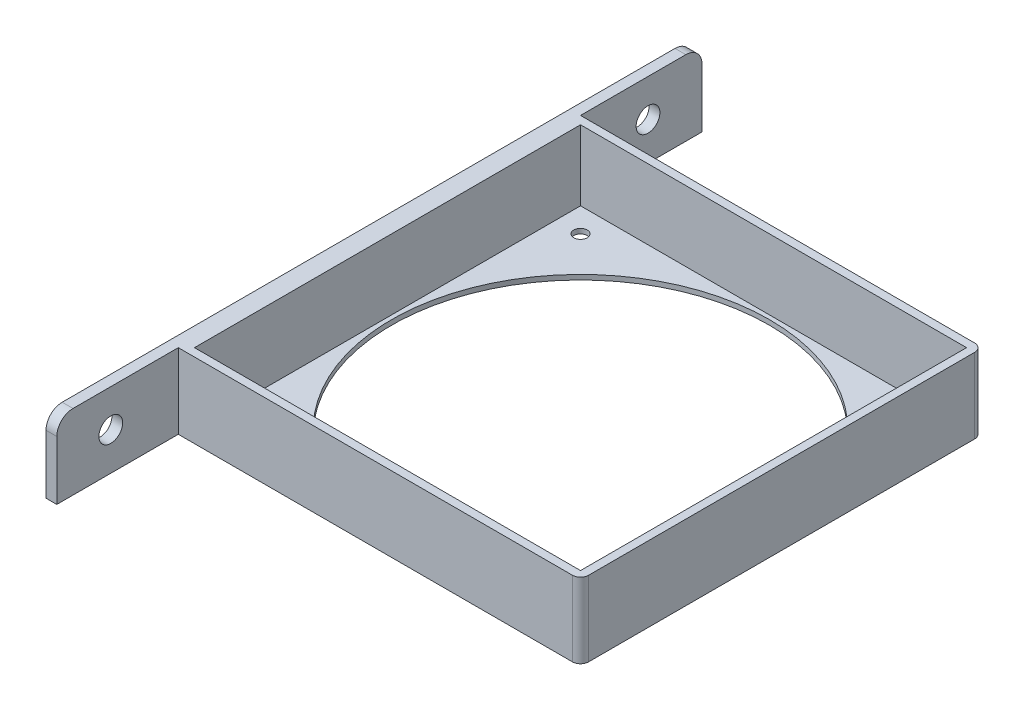
ISO-10303-21;
HEADER;
FILE_DESCRIPTION(('STEP AP214'),'2;1');
FILE_NAME('part.step','',(''),(''),'','','');
FILE_SCHEMA(('AUTOMOTIVE_DESIGN { 1 0 10303 214 1 1 1 1 }'));
ENDSEC;
DATA;
#1=APPLICATION_CONTEXT('core data for automotive mechanical design processes');
#2=APPLICATION_PROTOCOL_DEFINITION('international standard','automotive_design',2000,#1);
#3=PRODUCT_CONTEXT('',#1,'mechanical');
#4=PRODUCT('Part','Part','',(#3));
#5=PRODUCT_RELATED_PRODUCT_CATEGORY('part','',(#4));
#6=PRODUCT_DEFINITION_FORMATION('','',#4);
#7=PRODUCT_DEFINITION_CONTEXT('part definition',#1,'design');
#8=PRODUCT_DEFINITION('design','',#6,#7);
#9=PRODUCT_DEFINITION_SHAPE('','',#8);
#10=(LENGTH_UNIT() NAMED_UNIT(*) SI_UNIT(.MILLI.,.METRE.));
#11=(NAMED_UNIT(*) PLANE_ANGLE_UNIT() SI_UNIT($,.RADIAN.));
#12=(NAMED_UNIT(*) SI_UNIT($,.STERADIAN.) SOLID_ANGLE_UNIT());
#13=UNCERTAINTY_MEASURE_WITH_UNIT(LENGTH_MEASURE(1.E-05),#10,'distance_accuracy_value','');
#14=(GEOMETRIC_REPRESENTATION_CONTEXT(3) GLOBAL_UNCERTAINTY_ASSIGNED_CONTEXT((#13)) GLOBAL_UNIT_ASSIGNED_CONTEXT((#10,
#11,#12)) REPRESENTATION_CONTEXT('',''));
#15=CARTESIAN_POINT('',(0.,0.,0.));
#16=DIRECTION('',(0.,0.,1.));
#17=DIRECTION('',(1.,0.,0.));
#18=AXIS2_PLACEMENT_3D('',#15,#16,#17);
#19=CARTESIAN_POINT('',(71.5,26.,-71.5));
#20=DIRECTION('',(0.,1.,0.));
#21=DIRECTION('',(0.,0.,1.));
#22=AXIS2_PLACEMENT_3D('',#19,#20,#21);
#23=PLANE('',#22);
#24=DIRECTION('',(-1.,0.,0.));
#25=VECTOR('',#24,1.);
#26=CARTESIAN_POINT('',(-74.5,26.,-74.5));
#27=LINE('',#26,#25);
#28=CARTESIAN_POINT('',(71.5,26.,-74.5));
#29=VERTEX_POINT('',#28);
#30=CARTESIAN_POINT('',(-74.5,26.,-74.5));
#31=VERTEX_POINT('',#30);
#32=EDGE_CURVE('E256',#29,#31,#27,.T.);
#33=ORIENTED_EDGE('',*,*,#32,.T.);
#34=DIRECTION('',(0.,0.,-1.));
#35=VECTOR('',#34,1.);
#36=CARTESIAN_POINT('',(-74.5,26.,-113.5));
#37=LINE('',#36,#35);
#38=CARTESIAN_POINT('',(-74.5,26.,-113.5));
#39=VERTEX_POINT('',#38);
#40=EDGE_CURVE('E296',#31,#39,#37,.T.);
#41=ORIENTED_EDGE('',*,*,#40,.T.);
#42=DIRECTION('',(1.,0.,0.));
#43=VECTOR('',#42,1.);
#44=CARTESIAN_POINT('',(-78.5,26.,-113.5));
#45=LINE('',#44,#43);
#46=CARTESIAN_POINT('',(-78.5,26.,-113.5));
#47=VERTEX_POINT('',#46);
#48=EDGE_CURVE('E183',#47,#39,#45,.T.);
#49=ORIENTED_EDGE('',*,*,#48,.F.);
#50=DIRECTION('',(0.,0.,-1.));
#51=VECTOR('',#50,1.);
#52=CARTESIAN_POINT('',(-78.5,26.,-113.5));
#53=LINE('',#52,#51);
#54=CARTESIAN_POINT('',(-78.5,26.,113.5));
#55=VERTEX_POINT('',#54);
#56=EDGE_CURVE('E162',#55,#47,#53,.T.);
#57=ORIENTED_EDGE('',*,*,#56,.F.);
#58=DIRECTION('',(1.,0.,0.));
#59=VECTOR('',#58,1.);
#60=CARTESIAN_POINT('',(-78.5,26.,113.5));
#61=LINE('',#60,#59);
#62=CARTESIAN_POINT('',(-74.5,26.,113.5));
#63=VERTEX_POINT('',#62);
#64=EDGE_CURVE('E159',#55,#63,#61,.T.);
#65=ORIENTED_EDGE('',*,*,#64,.T.);
#66=CARTESIAN_POINT('',(-74.5,26.,74.5));
#67=VERTEX_POINT('',#66);
#68=EDGE_CURVE('E294',#63,#67,#37,.T.);
#69=ORIENTED_EDGE('',*,*,#68,.T.);
#70=DIRECTION('',(1.,0.,0.));
#71=VECTOR('',#70,1.);
#72=CARTESIAN_POINT('',(71.5,26.,74.5));
#73=LINE('',#72,#71);
#74=CARTESIAN_POINT('',(71.5,26.,74.5));
#75=VERTEX_POINT('',#74);
#76=EDGE_CURVE('E258',#67,#75,#73,.T.);
#77=ORIENTED_EDGE('',*,*,#76,.T.);
#78=CARTESIAN_POINT('',(71.5,26.,71.5));
#79=DIRECTION('',(0.,1.,0.));
#80=DIRECTION('',(0.,0.,1.));
#81=AXIS2_PLACEMENT_3D('',#78,#79,#80);
#82=CIRCLE('',#81,3.);
#83=CARTESIAN_POINT('',(74.5,26.,71.5));
#84=VERTEX_POINT('',#83);
#85=EDGE_CURVE('E260',#75,#84,#82,.T.);
#86=ORIENTED_EDGE('',*,*,#85,.T.);
#87=DIRECTION('',(0.,0.,-1.));
#88=VECTOR('',#87,1.);
#89=CARTESIAN_POINT('',(74.5,26.,-71.5));
#90=LINE('',#89,#88);
#91=CARTESIAN_POINT('',(74.5,26.,-71.5));
#92=VERTEX_POINT('',#91);
#93=EDGE_CURVE('E262',#84,#92,#90,.T.);
#94=ORIENTED_EDGE('',*,*,#93,.T.);
#95=CARTESIAN_POINT('',(71.5,26.,-71.5));
#96=DIRECTION('',(0.,1.,0.));
#97=DIRECTION('',(0.,0.,1.));
#98=AXIS2_PLACEMENT_3D('',#95,#96,#97);
#99=CIRCLE('',#98,3.);
#100=EDGE_CURVE('E62',#92,#29,#99,.T.);
#101=ORIENTED_EDGE('',*,*,#100,.T.);
#102=EDGE_LOOP('',(#33,#41,#49,#57,#65,#69,#77,#86,#94,#101));
#103=FACE_BOUND('',#102,.T.);
#104=DIRECTION('',(1.,0.,0.));
#105=VECTOR('',#104,1.);
#106=CARTESIAN_POINT('',(-71.4999999999999,26.,71.5));
#107=LINE('',#106,#105);
#108=CARTESIAN_POINT('',(-71.4999999999999,26.,71.5));
#109=VERTEX_POINT('',#108);
#110=CARTESIAN_POINT('',(71.5,26.,71.5));
#111=VERTEX_POINT('',#110);
#112=EDGE_CURVE('E231',#109,#111,#107,.T.);
#113=ORIENTED_EDGE('',*,*,#112,.F.);
#114=DIRECTION('',(0.,0.,1.));
#115=VECTOR('',#114,1.);
#116=CARTESIAN_POINT('',(-71.5,26.,-71.5));
#117=LINE('',#116,#115);
#118=CARTESIAN_POINT('',(-71.4999999999999,26.,-71.5));
#119=VERTEX_POINT('',#118);
#120=EDGE_CURVE('E229',#119,#109,#117,.T.);
#121=ORIENTED_EDGE('',*,*,#120,.F.);
#122=DIRECTION('',(-1.,0.,0.));
#123=VECTOR('',#122,1.);
#124=CARTESIAN_POINT('',(-71.4999999999999,26.,-71.5));
#125=LINE('',#124,#123);
#126=CARTESIAN_POINT('',(71.5,26.,-71.5));
#127=VERTEX_POINT('',#126);
#128=EDGE_CURVE('E236',#127,#119,#125,.T.);
#129=ORIENTED_EDGE('',*,*,#128,.F.);
#130=DIRECTION('',(0.,0.,-1.));
#131=VECTOR('',#130,1.);
#132=CARTESIAN_POINT('',(71.5,26.,-71.5));
#133=LINE('',#132,#131);
#134=EDGE_CURVE('E234',#111,#127,#133,.T.);
#135=ORIENTED_EDGE('',*,*,#134,.F.);
#136=EDGE_LOOP('',(#113,#121,#129,#135));
#137=FACE_BOUND('',#136,.T.);
#138=ADVANCED_FACE('F39',(#103,#137),#23,.T.);
#139=CARTESIAN_POINT('',(-74.5,26.,-74.5));
#140=DIRECTION('',(0.,0.,1.));
#141=DIRECTION('',(1.,0.,0.));
#142=AXIS2_PLACEMENT_3D('',#139,#140,#141);
#143=PLANE('',#142);
#144=DIRECTION('',(0.,-1.,0.));
#145=VECTOR('',#144,1.);
#146=CARTESIAN_POINT('',(71.5,26.,-74.5));
#147=LINE('',#146,#145);
#148=CARTESIAN_POINT('',(71.5,-1.8,-74.5));
#149=VERTEX_POINT('',#148);
#150=EDGE_CURVE('E265',#29,#149,#147,.T.);
#151=ORIENTED_EDGE('',*,*,#150,.T.);
#152=DIRECTION('',(1.,0.,0.));
#153=VECTOR('',#152,1.);
#154=CARTESIAN_POINT('',(-74.5,-1.8,-74.5));
#155=LINE('',#154,#153);
#156=CARTESIAN_POINT('',(-74.5,-1.8,-74.5));
#157=VERTEX_POINT('',#156);
#158=EDGE_CURVE('E211',#157,#149,#155,.T.);
#159=ORIENTED_EDGE('',*,*,#158,.F.);
#160=DIRECTION('',(0.,-1.,0.));
#161=VECTOR('',#160,1.);
#162=CARTESIAN_POINT('',(-74.5,26.,-74.5));
#163=LINE('',#162,#161);
#164=EDGE_CURVE('E11',#31,#157,#163,.T.);
#165=ORIENTED_EDGE('',*,*,#164,.F.);
#166=ORIENTED_EDGE('',*,*,#32,.F.);
#167=EDGE_LOOP('',(#151,#159,#165,#166));
#168=FACE_BOUND('',#167,.T.);
#169=ADVANCED_FACE('F41',(#168),#143,.F.);
#170=CARTESIAN_POINT('',(71.5,26.,74.5));
#171=DIRECTION('',(0.,0.,-1.));
#172=DIRECTION('',(-1.,0.,0.));
#173=AXIS2_PLACEMENT_3D('',#170,#171,#172);
#174=PLANE('',#173);
#175=DIRECTION('',(0.,-1.,0.));
#176=VECTOR('',#175,1.);
#177=CARTESIAN_POINT('',(-74.5,26.,74.5));
#178=LINE('',#177,#176);
#179=CARTESIAN_POINT('',(-74.5,-1.8,74.5));
#180=VERTEX_POINT('',#179);
#181=EDGE_CURVE('E47',#67,#180,#178,.T.);
#182=ORIENTED_EDGE('',*,*,#181,.T.);
#183=DIRECTION('',(-1.,0.,0.));
#184=VECTOR('',#183,1.);
#185=CARTESIAN_POINT('',(71.5,-1.8,74.5));
#186=LINE('',#185,#184);
#187=CARTESIAN_POINT('',(71.5,-1.8,74.5));
#188=VERTEX_POINT('',#187);
#189=EDGE_CURVE('E225',#188,#180,#186,.T.);
#190=ORIENTED_EDGE('',*,*,#189,.F.);
#191=DIRECTION('',(0.,-1.,0.));
#192=VECTOR('',#191,1.);
#193=CARTESIAN_POINT('',(71.5,26.,74.5));
#194=LINE('',#193,#192);
#195=EDGE_CURVE('E271',#75,#188,#194,.T.);
#196=ORIENTED_EDGE('',*,*,#195,.F.);
#197=ORIENTED_EDGE('',*,*,#76,.F.);
#198=EDGE_LOOP('',(#182,#190,#196,#197));
#199=FACE_BOUND('',#198,.T.);
#200=ADVANCED_FACE('F276',(#199),#174,.F.);
#201=CARTESIAN_POINT('',(71.5,26.,71.5));
#202=DIRECTION('',(0.,-1.,0.));
#203=DIRECTION('',(0.,0.,-1.));
#204=AXIS2_PLACEMENT_3D('',#201,#202,#203);
#205=CYLINDRICAL_SURFACE('',#204,3.);
#206=ORIENTED_EDGE('',*,*,#195,.T.);
#207=CARTESIAN_POINT('',(71.5,-1.8,71.5));
#208=DIRECTION('',(0.,-1.,0.));
#209=DIRECTION('',(0.,0.,-1.));
#210=AXIS2_PLACEMENT_3D('',#207,#208,#209);
#211=CIRCLE('',#210,3.);
#212=CARTESIAN_POINT('',(74.5,-1.8,71.5));
#213=VERTEX_POINT('',#212);
#214=EDGE_CURVE('E222',#213,#188,#211,.T.);
#215=ORIENTED_EDGE('',*,*,#214,.F.);
#216=DIRECTION('',(0.,-1.,0.));
#217=VECTOR('',#216,1.);
#218=CARTESIAN_POINT('',(74.5,26.,71.5));
#219=LINE('',#218,#217);
#220=EDGE_CURVE('E269',#84,#213,#219,.T.);
#221=ORIENTED_EDGE('',*,*,#220,.F.);
#222=ORIENTED_EDGE('',*,*,#85,.F.);
#223=EDGE_LOOP('',(#206,#215,#221,#222));
#224=FACE_BOUND('',#223,.T.);
#225=ADVANCED_FACE('F289',(#224),#205,.T.);
#226=CARTESIAN_POINT('',(74.5,26.,-71.5));
#227=DIRECTION('',(-1.,0.,0.));
#228=DIRECTION('',(0.,0.,1.));
#229=AXIS2_PLACEMENT_3D('',#226,#227,#228);
#230=PLANE('',#229);
#231=ORIENTED_EDGE('',*,*,#220,.T.);
#232=DIRECTION('',(0.,0.,1.));
#233=VECTOR('',#232,1.);
#234=CARTESIAN_POINT('',(74.5,-1.8,-71.5));
#235=LINE('',#234,#233);
#236=CARTESIAN_POINT('',(74.5,-1.8,-71.5));
#237=VERTEX_POINT('',#236);
#238=EDGE_CURVE('E219',#237,#213,#235,.T.);
#239=ORIENTED_EDGE('',*,*,#238,.F.);
#240=DIRECTION('',(0.,-1.,0.));
#241=VECTOR('',#240,1.);
#242=CARTESIAN_POINT('',(74.5,26.,-71.5));
#243=LINE('',#242,#241);
#244=EDGE_CURVE('E267',#92,#237,#243,.T.);
#245=ORIENTED_EDGE('',*,*,#244,.F.);
#246=ORIENTED_EDGE('',*,*,#93,.F.);
#247=EDGE_LOOP('',(#231,#239,#245,#246));
#248=FACE_BOUND('',#247,.T.);
#249=ADVANCED_FACE('F380',(#248),#230,.F.);
#250=CARTESIAN_POINT('',(71.5,26.,-71.5));
#251=DIRECTION('',(0.,-1.,0.));
#252=DIRECTION('',(0.,0.,-1.));
#253=AXIS2_PLACEMENT_3D('',#250,#251,#252);
#254=CYLINDRICAL_SURFACE('',#253,3.);
#255=ORIENTED_EDGE('',*,*,#244,.T.);
#256=CARTESIAN_POINT('',(71.5,-1.8,-71.5));
#257=DIRECTION('',(0.,-1.,0.));
#258=DIRECTION('',(0.,0.,-1.));
#259=AXIS2_PLACEMENT_3D('',#256,#257,#258);
#260=CIRCLE('',#259,3.);
#261=EDGE_CURVE('E216',#149,#237,#260,.T.);
#262=ORIENTED_EDGE('',*,*,#261,.F.);
#263=ORIENTED_EDGE('',*,*,#150,.F.);
#264=ORIENTED_EDGE('',*,*,#100,.F.);
#265=EDGE_LOOP('',(#255,#262,#263,#264));
#266=FACE_BOUND('',#265,.T.);
#267=ADVANCED_FACE('F377',(#266),#254,.T.);
#268=CARTESIAN_POINT('',(-71.5,26.,-71.5));
#269=DIRECTION('',(1.,0.,0.));
#270=DIRECTION('',(0.,0.,-1.));
#271=AXIS2_PLACEMENT_3D('',#268,#269,#270);
#272=PLANE('',#271);
#273=DIRECTION('',(0.,0.,1.));
#274=VECTOR('',#273,1.);
#275=CARTESIAN_POINT('',(-71.5,0.,-71.5));
#276=LINE('',#275,#274);
#277=CARTESIAN_POINT('',(-71.5,0.,-71.5));
#278=VERTEX_POINT('',#277);
#279=CARTESIAN_POINT('',(-71.4999999999999,0.,71.5));
#280=VERTEX_POINT('',#279);
#281=EDGE_CURVE('E228',#278,#280,#276,.T.);
#282=ORIENTED_EDGE('',*,*,#281,.F.);
#283=DIRECTION('',(0.,-1.,0.));
#284=VECTOR('',#283,1.);
#285=CARTESIAN_POINT('',(-71.4999999999999,26.,-71.5));
#286=LINE('',#285,#284);
#287=EDGE_CURVE('E238',#119,#278,#286,.T.);
#288=ORIENTED_EDGE('',*,*,#287,.F.);
#289=ORIENTED_EDGE('',*,*,#120,.T.);
#290=DIRECTION('',(0.,-1.,0.));
#291=VECTOR('',#290,1.);
#292=CARTESIAN_POINT('',(-71.4999999999999,26.,71.5));
#293=LINE('',#292,#291);
#294=EDGE_CURVE('E253',#109,#280,#293,.T.);
#295=ORIENTED_EDGE('',*,*,#294,.T.);
#296=EDGE_LOOP('',(#282,#288,#289,#295));
#297=FACE_BOUND('',#296,.T.);
#298=ADVANCED_FACE('F375',(#297),#272,.T.);
#299=CARTESIAN_POINT('',(-71.4999999999999,26.,71.5));
#300=DIRECTION('',(0.,0.,-1.));
#301=DIRECTION('',(-1.,0.,0.));
#302=AXIS2_PLACEMENT_3D('',#299,#300,#301);
#303=PLANE('',#302);
#304=DIRECTION('',(1.,0.,0.));
#305=VECTOR('',#304,1.);
#306=CARTESIAN_POINT('',(-71.4999999999999,0.,71.5));
#307=LINE('',#306,#305);
#308=CARTESIAN_POINT('',(71.5,0.,71.5));
#309=VERTEX_POINT('',#308);
#310=EDGE_CURVE('E241',#280,#309,#307,.T.);
#311=ORIENTED_EDGE('',*,*,#310,.F.);
#312=ORIENTED_EDGE('',*,*,#294,.F.);
#313=ORIENTED_EDGE('',*,*,#112,.T.);
#314=DIRECTION('',(0.,-1.,0.));
#315=VECTOR('',#314,1.);
#316=CARTESIAN_POINT('',(71.5,26.,71.5));
#317=LINE('',#316,#315);
#318=EDGE_CURVE('E251',#111,#309,#317,.T.);
#319=ORIENTED_EDGE('',*,*,#318,.T.);
#320=EDGE_LOOP('',(#311,#312,#313,#319));
#321=FACE_BOUND('',#320,.T.);
#322=ADVANCED_FACE('F498',(#321),#303,.T.);
#323=CARTESIAN_POINT('',(71.5,26.,-71.5));
#324=DIRECTION('',(-1.,0.,0.));
#325=DIRECTION('',(0.,0.,1.));
#326=AXIS2_PLACEMENT_3D('',#323,#324,#325);
#327=PLANE('',#326);
#328=DIRECTION('',(0.,0.,-1.));
#329=VECTOR('',#328,1.);
#330=CARTESIAN_POINT('',(71.5,0.,-71.5));
#331=LINE('',#330,#329);
#332=CARTESIAN_POINT('',(71.5,0.,-71.5));
#333=VERTEX_POINT('',#332);
#334=EDGE_CURVE('E244',#309,#333,#331,.T.);
#335=ORIENTED_EDGE('',*,*,#334,.F.);
#336=ORIENTED_EDGE('',*,*,#318,.F.);
#337=ORIENTED_EDGE('',*,*,#134,.T.);
#338=DIRECTION('',(0.,-1.,0.));
#339=VECTOR('',#338,1.);
#340=CARTESIAN_POINT('',(71.5,26.,-71.5));
#341=LINE('',#340,#339);
#342=EDGE_CURVE('E54',#127,#333,#341,.T.);
#343=ORIENTED_EDGE('',*,*,#342,.T.);
#344=EDGE_LOOP('',(#335,#336,#337,#343));
#345=FACE_BOUND('',#344,.T.);
#346=ADVANCED_FACE('F496',(#345),#327,.T.);
#347=CARTESIAN_POINT('',(-71.4999999999999,26.,-71.5));
#348=DIRECTION('',(0.,0.,1.));
#349=DIRECTION('',(1.,0.,0.));
#350=AXIS2_PLACEMENT_3D('',#347,#348,#349);
#351=PLANE('',#350);
#352=DIRECTION('',(-1.,0.,0.));
#353=VECTOR('',#352,1.);
#354=CARTESIAN_POINT('',(-71.4999999999999,0.,-71.5));
#355=LINE('',#354,#353);
#356=EDGE_CURVE('E232',#333,#278,#355,.T.);
#357=ORIENTED_EDGE('',*,*,#356,.F.);
#358=ORIENTED_EDGE('',*,*,#342,.F.);
#359=ORIENTED_EDGE('',*,*,#128,.T.);
#360=ORIENTED_EDGE('',*,*,#287,.T.);
#361=EDGE_LOOP('',(#357,#358,#359,#360));
#362=FACE_BOUND('',#361,.T.);
#363=ADVANCED_FACE('F492',(#362),#351,.T.);
#364=CARTESIAN_POINT('',(71.5,0.,-71.5));
#365=DIRECTION('',(0.,-1.,0.));
#366=DIRECTION('',(0.,0.,-1.));
#367=AXIS2_PLACEMENT_3D('',#364,#365,#366);
#368=PLANE('',#367);
#369=CARTESIAN_POINT('',(-62.5000000000007,0.,-62.4999999999994));
#370=DIRECTION('',(0.,-1.,0.));
#371=DIRECTION('',(0.,0.,-1.));
#372=AXIS2_PLACEMENT_3D('',#369,#370,#371);
#373=CIRCLE('',#372,2.5);
#374=CARTESIAN_POINT('',(-62.5000000000007,0.,-64.9999999999993));
#375=VERTEX_POINT('',#374);
#376=EDGE_CURVE('E178',#375,#375,#373,.T.);
#377=ORIENTED_EDGE('',*,*,#376,.T.);
#378=EDGE_LOOP('',(#377));
#379=FACE_BOUND('',#378,.T.);
#380=CARTESIAN_POINT('',(62.4999999999996,0.,-62.5000000000004));
#381=DIRECTION('',(0.,-1.,0.));
#382=DIRECTION('',(0.,0.,-1.));
#383=AXIS2_PLACEMENT_3D('',#380,#381,#382);
#384=CIRCLE('',#383,2.50000000000001);
#385=CARTESIAN_POINT('',(62.4999999999996,0.,-65.0000000000004));
#386=VERTEX_POINT('',#385);
#387=EDGE_CURVE('E188',#386,#386,#384,.T.);
#388=ORIENTED_EDGE('',*,*,#387,.T.);
#389=EDGE_LOOP('',(#388));
#390=FACE_BOUND('',#389,.T.);
#391=CARTESIAN_POINT('',(62.5000000000002,0.,62.4999999999998));
#392=DIRECTION('',(0.,-1.,0.));
#393=DIRECTION('',(0.,0.,-1.));
#394=AXIS2_PLACEMENT_3D('',#391,#392,#393);
#395=CIRCLE('',#394,2.50000000000001);
#396=CARTESIAN_POINT('',(62.5000000000002,0.,59.9999999999998));
#397=VERTEX_POINT('',#396);
#398=EDGE_CURVE('E193',#397,#397,#395,.T.);
#399=ORIENTED_EDGE('',*,*,#398,.T.);
#400=EDGE_LOOP('',(#399));
#401=FACE_BOUND('',#400,.T.);
#402=CARTESIAN_POINT('',(-62.5,0.,62.5));
#403=DIRECTION('',(0.,-1.,0.));
#404=DIRECTION('',(0.,0.,-1.));
#405=AXIS2_PLACEMENT_3D('',#402,#403,#404);
#406=CIRCLE('',#405,2.5);
#407=CARTESIAN_POINT('',(-62.5,0.,60.));
#408=VERTEX_POINT('',#407);
#409=EDGE_CURVE('E199',#408,#408,#406,.T.);
#410=ORIENTED_EDGE('',*,*,#409,.T.);
#411=EDGE_LOOP('',(#410));
#412=FACE_BOUND('',#411,.T.);
#413=CARTESIAN_POINT('',(0.,0.,0.));
#414=DIRECTION('',(0.,-1.,0.));
#415=DIRECTION('',(0.,0.,-1.));
#416=AXIS2_PLACEMENT_3D('',#413,#414,#415);
#417=CIRCLE('',#416,70.);
#418=CARTESIAN_POINT('',(0.,0.,-70.));
#419=VERTEX_POINT('',#418);
#420=EDGE_CURVE('E205',#419,#419,#417,.T.);
#421=ORIENTED_EDGE('',*,*,#420,.T.);
#422=EDGE_LOOP('',(#421));
#423=FACE_BOUND('',#422,.T.);
#424=ORIENTED_EDGE('',*,*,#356,.T.);
#425=ORIENTED_EDGE('',*,*,#281,.T.);
#426=ORIENTED_EDGE('',*,*,#310,.T.);
#427=ORIENTED_EDGE('',*,*,#334,.T.);
#428=EDGE_LOOP('',(#424,#425,#426,#427));
#429=FACE_BOUND('',#428,.T.);
#430=ADVANCED_FACE('F399',(#379,#390,#401,#412,#423,#429),#368,.F.);
#431=CARTESIAN_POINT('',(71.5,-1.8,-71.5));
#432=DIRECTION('',(0.,-1.,0.));
#433=DIRECTION('',(0.,0.,-1.));
#434=AXIS2_PLACEMENT_3D('',#431,#432,#433);
#435=PLANE('',#434);
#436=CARTESIAN_POINT('',(62.4999999999996,-1.8,-62.5000000000004));
#437=DIRECTION('',(0.,-1.,0.));
#438=DIRECTION('',(0.,0.,-1.));
#439=AXIS2_PLACEMENT_3D('',#436,#437,#438);
#440=CIRCLE('',#439,2.50000000000001);
#441=CARTESIAN_POINT('',(62.4999999999996,-1.8,-65.0000000000004));
#442=VERTEX_POINT('',#441);
#443=EDGE_CURVE('E190',#442,#442,#440,.T.);
#444=ORIENTED_EDGE('',*,*,#443,.F.);
#445=EDGE_LOOP('',(#444));
#446=FACE_BOUND('',#445,.T.);
#447=CARTESIAN_POINT('',(-62.5,-1.8,62.5));
#448=DIRECTION('',(0.,-1.,0.));
#449=DIRECTION('',(0.,0.,-1.));
#450=AXIS2_PLACEMENT_3D('',#447,#448,#449);
#451=CIRCLE('',#450,2.5);
#452=CARTESIAN_POINT('',(-62.5,-1.8,60.));
#453=VERTEX_POINT('',#452);
#454=EDGE_CURVE('E202',#453,#453,#451,.T.);
#455=ORIENTED_EDGE('',*,*,#454,.F.);
#456=EDGE_LOOP('',(#455));
#457=FACE_BOUND('',#456,.T.);
#458=ORIENTED_EDGE('',*,*,#158,.T.);
#459=ORIENTED_EDGE('',*,*,#261,.T.);
#460=ORIENTED_EDGE('',*,*,#238,.T.);
#461=ORIENTED_EDGE('',*,*,#214,.T.);
#462=ORIENTED_EDGE('',*,*,#189,.T.);
#463=DIRECTION('',(0.,0.,1.));
#464=VECTOR('',#463,1.);
#465=CARTESIAN_POINT('',(-74.5,-1.8,-119.5));
#466=LINE('',#465,#464);
#467=CARTESIAN_POINT('',(-74.5,-1.8,119.5));
#468=VERTEX_POINT('',#467);
#469=EDGE_CURVE('E284',#180,#468,#466,.T.);
#470=ORIENTED_EDGE('',*,*,#469,.T.);
#471=DIRECTION('',(1.,0.,0.));
#472=VECTOR('',#471,1.);
#473=CARTESIAN_POINT('',(-78.5,-1.8,119.5));
#474=LINE('',#473,#472);
#475=CARTESIAN_POINT('',(-78.5,-1.8,119.5));
#476=VERTEX_POINT('',#475);
#477=EDGE_CURVE('E307',#476,#468,#474,.T.);
#478=ORIENTED_EDGE('',*,*,#477,.F.);
#479=DIRECTION('',(0.,0.,1.));
#480=VECTOR('',#479,1.);
#481=CARTESIAN_POINT('',(-78.5,-1.8,-119.5));
#482=LINE('',#481,#480);
#483=CARTESIAN_POINT('',(-78.5,-1.8,-119.5));
#484=VERTEX_POINT('',#483);
#485=EDGE_CURVE('E169',#484,#476,#482,.T.);
#486=ORIENTED_EDGE('',*,*,#485,.F.);
#487=DIRECTION('',(1.,0.,0.));
#488=VECTOR('',#487,1.);
#489=CARTESIAN_POINT('',(-78.5,-1.8,-119.5));
#490=LINE('',#489,#488);
#491=CARTESIAN_POINT('',(-74.5,-1.8,-119.5));
#492=VERTEX_POINT('',#491);
#493=EDGE_CURVE('E309',#484,#492,#490,.T.);
#494=ORIENTED_EDGE('',*,*,#493,.T.);
#495=EDGE_CURVE('E173',#492,#157,#466,.T.);
#496=ORIENTED_EDGE('',*,*,#495,.T.);
#497=EDGE_LOOP('',(#458,#459,#460,#461,#462,#470,#478,#486,#494,#496));
#498=FACE_BOUND('',#497,.T.);
#499=CARTESIAN_POINT('',(0.,-1.8,0.));
#500=DIRECTION('',(0.,-1.,0.));
#501=DIRECTION('',(0.,0.,-1.));
#502=AXIS2_PLACEMENT_3D('',#499,#500,#501);
#503=CIRCLE('',#502,70.);
#504=CARTESIAN_POINT('',(0.,-1.8,-70.));
#505=VERTEX_POINT('',#504);
#506=EDGE_CURVE('E208',#505,#505,#503,.T.);
#507=ORIENTED_EDGE('',*,*,#506,.F.);
#508=EDGE_LOOP('',(#507));
#509=FACE_BOUND('',#508,.T.);
#510=CARTESIAN_POINT('',(62.5000000000002,-1.8,62.4999999999998));
#511=DIRECTION('',(0.,-1.,0.));
#512=DIRECTION('',(0.,0.,-1.));
#513=AXIS2_PLACEMENT_3D('',#510,#511,#512);
#514=CIRCLE('',#513,2.50000000000001);
#515=CARTESIAN_POINT('',(62.5000000000002,-1.8,59.9999999999998));
#516=VERTEX_POINT('',#515);
#517=EDGE_CURVE('E196',#516,#516,#514,.T.);
#518=ORIENTED_EDGE('',*,*,#517,.F.);
#519=EDGE_LOOP('',(#518));
#520=FACE_BOUND('',#519,.T.);
#521=CARTESIAN_POINT('',(-62.5000000000007,-1.8,-62.4999999999994));
#522=DIRECTION('',(0.,-1.,0.));
#523=DIRECTION('',(0.,0.,-1.));
#524=AXIS2_PLACEMENT_3D('',#521,#522,#523);
#525=CIRCLE('',#524,2.5);
#526=CARTESIAN_POINT('',(-62.5000000000007,-1.8,-64.9999999999993));
#527=VERTEX_POINT('',#526);
#528=EDGE_CURVE('E181',#527,#527,#525,.T.);
#529=ORIENTED_EDGE('',*,*,#528,.F.);
#530=EDGE_LOOP('',(#529));
#531=FACE_BOUND('',#530,.T.);
#532=ADVANCED_FACE('F282',(#446,#457,#498,#509,#520,#531),#435,.T.);
#533=CARTESIAN_POINT('',(0.,-1.8,0.));
#534=DIRECTION('',(0.,1.,0.));
#535=DIRECTION('',(0.,0.,1.));
#536=AXIS2_PLACEMENT_3D('',#533,#534,#535);
#537=CYLINDRICAL_SURFACE('',#536,70.);
#538=ORIENTED_EDGE('',*,*,#506,.T.);
#539=EDGE_LOOP('',(#538));
#540=FACE_BOUND('',#539,.T.);
#541=ORIENTED_EDGE('',*,*,#420,.F.);
#542=EDGE_LOOP('',(#541));
#543=FACE_BOUND('',#542,.T.);
#544=ADVANCED_FACE('F398',(#540,#543),#537,.F.);
#545=CARTESIAN_POINT('',(-62.5,-1.8,62.5));
#546=DIRECTION('',(0.,1.,0.));
#547=DIRECTION('',(0.,0.,1.));
#548=AXIS2_PLACEMENT_3D('',#545,#546,#547);
#549=CYLINDRICAL_SURFACE('',#548,2.5);
#550=ORIENTED_EDGE('',*,*,#454,.T.);
#551=EDGE_LOOP('',(#550));
#552=FACE_BOUND('',#551,.T.);
#553=ORIENTED_EDGE('',*,*,#409,.F.);
#554=EDGE_LOOP('',(#553));
#555=FACE_BOUND('',#554,.T.);
#556=ADVANCED_FACE('F482',(#552,#555),#549,.F.);
#557=CARTESIAN_POINT('',(62.5000000000002,-1.8,62.4999999999998));
#558=DIRECTION('',(0.,1.,0.));
#559=DIRECTION('',(0.,0.,1.));
#560=AXIS2_PLACEMENT_3D('',#557,#558,#559);
#561=CYLINDRICAL_SURFACE('',#560,2.50000000000001);
#562=ORIENTED_EDGE('',*,*,#517,.T.);
#563=EDGE_LOOP('',(#562));
#564=FACE_BOUND('',#563,.T.);
#565=ORIENTED_EDGE('',*,*,#398,.F.);
#566=EDGE_LOOP('',(#565));
#567=FACE_BOUND('',#566,.T.);
#568=ADVANCED_FACE('F478',(#564,#567),#561,.F.);
#569=CARTESIAN_POINT('',(62.4999999999996,-1.8,-62.5000000000004));
#570=DIRECTION('',(0.,1.,0.));
#571=DIRECTION('',(0.,0.,1.));
#572=AXIS2_PLACEMENT_3D('',#569,#570,#571);
#573=CYLINDRICAL_SURFACE('',#572,2.50000000000001);
#574=ORIENTED_EDGE('',*,*,#443,.T.);
#575=EDGE_LOOP('',(#574));
#576=FACE_BOUND('',#575,.T.);
#577=ORIENTED_EDGE('',*,*,#387,.F.);
#578=EDGE_LOOP('',(#577));
#579=FACE_BOUND('',#578,.T.);
#580=ADVANCED_FACE('F474',(#576,#579),#573,.F.);
#581=CARTESIAN_POINT('',(-62.5000000000007,-1.8,-62.4999999999994));
#582=DIRECTION('',(0.,1.,0.));
#583=DIRECTION('',(0.,0.,1.));
#584=AXIS2_PLACEMENT_3D('',#581,#582,#583);
#585=CYLINDRICAL_SURFACE('',#584,2.5);
#586=ORIENTED_EDGE('',*,*,#528,.T.);
#587=EDGE_LOOP('',(#586));
#588=FACE_BOUND('',#587,.T.);
#589=ORIENTED_EDGE('',*,*,#376,.F.);
#590=EDGE_LOOP('',(#589));
#591=FACE_BOUND('',#590,.T.);
#592=ADVANCED_FACE('F363',(#588,#591),#585,.F.);
#593=CARTESIAN_POINT('',(-74.5,20.,-113.5));
#594=DIRECTION('',(-1.,0.,0.));
#595=DIRECTION('',(0.,0.,1.));
#596=AXIS2_PLACEMENT_3D('',#593,#594,#595);
#597=PLANE('',#596);
#598=CARTESIAN_POINT('',(-74.5,12.2,-99.5));
#599=DIRECTION('',(-1.,0.,0.));
#600=DIRECTION('',(0.,0.,1.));
#601=AXIS2_PLACEMENT_3D('',#598,#599,#600);
#602=CIRCLE('',#601,4.4);
#603=CARTESIAN_POINT('',(-74.5,12.2,-95.1));
#604=VERTEX_POINT('',#603);
#605=EDGE_CURVE('E337',#604,#604,#602,.T.);
#606=ORIENTED_EDGE('',*,*,#605,.T.);
#607=EDGE_LOOP('',(#606));
#608=FACE_BOUND('',#607,.T.);
#609=ORIENTED_EDGE('',*,*,#40,.F.);
#610=ORIENTED_EDGE('',*,*,#164,.T.);
#611=ORIENTED_EDGE('',*,*,#495,.F.);
#612=DIRECTION('',(0.,-1.,0.));
#613=VECTOR('',#612,1.);
#614=CARTESIAN_POINT('',(-74.5,20.,-119.5));
#615=LINE('',#614,#613);
#616=CARTESIAN_POINT('',(-74.5,20.,-119.5));
#617=VERTEX_POINT('',#616);
#618=EDGE_CURVE('E298',#617,#492,#615,.T.);
#619=ORIENTED_EDGE('',*,*,#618,.F.);
#620=CARTESIAN_POINT('',(-74.5,20.,-113.5));
#621=DIRECTION('',(-1.,0.,0.));
#622=DIRECTION('',(0.,0.,1.));
#623=AXIS2_PLACEMENT_3D('',#620,#621,#622);
#624=CIRCLE('',#623,6.);
#625=EDGE_CURVE('E295',#39,#617,#624,.T.);
#626=ORIENTED_EDGE('',*,*,#625,.F.);
#627=EDGE_LOOP('',(#609,#610,#611,#619,#626));
#628=FACE_BOUND('',#627,.T.);
#629=ADVANCED_FACE('F324',(#608,#628),#597,.F.);
#630=CARTESIAN_POINT('',(-78.5,20.,-113.5));
#631=DIRECTION('',(-1.,0.,0.));
#632=DIRECTION('',(0.,0.,1.));
#633=AXIS2_PLACEMENT_3D('',#630,#631,#632);
#634=PLANE('',#633);
#635=CARTESIAN_POINT('',(-78.5,12.2,-99.5));
#636=DIRECTION('',(-1.,0.,0.));
#637=DIRECTION('',(0.,0.,1.));
#638=AXIS2_PLACEMENT_3D('',#635,#636,#637);
#639=CIRCLE('',#638,4.4);
#640=CARTESIAN_POINT('',(-78.5,12.2,-95.1));
#641=VERTEX_POINT('',#640);
#642=EDGE_CURVE('E335',#641,#641,#639,.T.);
#643=ORIENTED_EDGE('',*,*,#642,.F.);
#644=EDGE_LOOP('',(#643));
#645=FACE_BOUND('',#644,.T.);
#646=DIRECTION('',(0.,1.,0.));
#647=VECTOR('',#646,1.);
#648=CARTESIAN_POINT('',(-78.5,20.,119.5));
#649=LINE('',#648,#647);
#650=CARTESIAN_POINT('',(-78.5,20.,119.5));
#651=VERTEX_POINT('',#650);
#652=EDGE_CURVE('E163',#476,#651,#649,.T.);
#653=ORIENTED_EDGE('',*,*,#652,.T.);
#654=CARTESIAN_POINT('',(-78.5,20.,113.5));
#655=DIRECTION('',(-1.,0.,0.));
#656=DIRECTION('',(0.,0.,-1.));
#657=AXIS2_PLACEMENT_3D('',#654,#655,#656);
#658=CIRCLE('',#657,6.);
#659=EDGE_CURVE('E152',#651,#55,#658,.T.);
#660=ORIENTED_EDGE('',*,*,#659,.T.);
#661=ORIENTED_EDGE('',*,*,#56,.T.);
#662=CARTESIAN_POINT('',(-78.5,20.,-113.5));
#663=DIRECTION('',(-1.,0.,0.));
#664=DIRECTION('',(0.,0.,1.));
#665=AXIS2_PLACEMENT_3D('',#662,#663,#664);
#666=CIRCLE('',#665,6.);
#667=CARTESIAN_POINT('',(-78.5,20.,-119.5));
#668=VERTEX_POINT('',#667);
#669=EDGE_CURVE('E321',#47,#668,#666,.T.);
#670=ORIENTED_EDGE('',*,*,#669,.T.);
#671=DIRECTION('',(0.,-1.,0.));
#672=VECTOR('',#671,1.);
#673=CARTESIAN_POINT('',(-78.5,20.,-119.5));
#674=LINE('',#673,#672);
#675=EDGE_CURVE('E331',#668,#484,#674,.T.);
#676=ORIENTED_EDGE('',*,*,#675,.T.);
#677=ORIENTED_EDGE('',*,*,#485,.T.);
#678=EDGE_LOOP('',(#653,#660,#661,#670,#676,#677));
#679=FACE_BOUND('',#678,.T.);
#680=CARTESIAN_POINT('',(-78.5,12.2,99.5));
#681=DIRECTION('',(-1.,0.,0.));
#682=DIRECTION('',(0.,0.,1.));
#683=AXIS2_PLACEMENT_3D('',#680,#681,#682);
#684=CIRCLE('',#683,4.4);
#685=CARTESIAN_POINT('',(-78.5,12.2,103.9));
#686=VERTEX_POINT('',#685);
#687=EDGE_CURVE('E342',#686,#686,#684,.T.);
#688=ORIENTED_EDGE('',*,*,#687,.F.);
#689=EDGE_LOOP('',(#688));
#690=FACE_BOUND('',#689,.T.);
#691=ADVANCED_FACE('F166',(#645,#679,#690),#634,.T.);
#692=ORIENTED_EDGE('',*,*,#181,.F.);
#693=ORIENTED_EDGE('',*,*,#68,.F.);
#694=CARTESIAN_POINT('',(-74.5,20.,113.5));
#695=DIRECTION('',(-1.,0.,0.));
#696=DIRECTION('',(0.,0.,-1.));
#697=AXIS2_PLACEMENT_3D('',#694,#695,#696);
#698=CIRCLE('',#697,6.);
#699=CARTESIAN_POINT('',(-74.5,20.,119.5));
#700=VERTEX_POINT('',#699);
#701=EDGE_CURVE('E300',#700,#63,#698,.T.);
#702=ORIENTED_EDGE('',*,*,#701,.F.);
#703=DIRECTION('',(0.,1.,0.));
#704=VECTOR('',#703,1.);
#705=CARTESIAN_POINT('',(-74.5,20.,119.5));
#706=LINE('',#705,#704);
#707=EDGE_CURVE('E177',#468,#700,#706,.T.);
#708=ORIENTED_EDGE('',*,*,#707,.F.);
#709=ORIENTED_EDGE('',*,*,#469,.F.);
#710=EDGE_LOOP('',(#692,#693,#702,#708,#709));
#711=FACE_BOUND('',#710,.T.);
#712=CARTESIAN_POINT('',(-74.5,12.2,99.5));
#713=DIRECTION('',(-1.,0.,0.));
#714=DIRECTION('',(0.,0.,1.));
#715=AXIS2_PLACEMENT_3D('',#712,#713,#714);
#716=CIRCLE('',#715,4.4);
#717=CARTESIAN_POINT('',(-74.5,12.2,103.9));
#718=VERTEX_POINT('',#717);
#719=EDGE_CURVE('E345',#718,#718,#716,.T.);
#720=ORIENTED_EDGE('',*,*,#719,.T.);
#721=EDGE_LOOP('',(#720));
#722=FACE_BOUND('',#721,.T.);
#723=ADVANCED_FACE('F355',(#711,#722),#597,.F.);
#724=CARTESIAN_POINT('',(-78.5,20.,119.5));
#725=DIRECTION('',(0.,0.,-1.));
#726=DIRECTION('',(0.,1.,0.));
#727=AXIS2_PLACEMENT_3D('',#724,#725,#726);
#728=PLANE('',#727);
#729=ORIENTED_EDGE('',*,*,#707,.T.);
#730=DIRECTION('',(1.,0.,0.));
#731=VECTOR('',#730,1.);
#732=CARTESIAN_POINT('',(-78.5,20.,119.5));
#733=LINE('',#732,#731);
#734=EDGE_CURVE('E156',#651,#700,#733,.T.);
#735=ORIENTED_EDGE('',*,*,#734,.F.);
#736=ORIENTED_EDGE('',*,*,#652,.F.);
#737=ORIENTED_EDGE('',*,*,#477,.T.);
#738=EDGE_LOOP('',(#729,#735,#736,#737));
#739=FACE_BOUND('',#738,.T.);
#740=ADVANCED_FACE('F175',(#739),#728,.F.);
#741=CARTESIAN_POINT('',(-78.5,20.,113.5));
#742=DIRECTION('',(1.,0.,0.));
#743=DIRECTION('',(0.,0.,-1.));
#744=AXIS2_PLACEMENT_3D('',#741,#742,#743);
#745=CYLINDRICAL_SURFACE('',#744,6.);
#746=ORIENTED_EDGE('',*,*,#701,.T.);
#747=ORIENTED_EDGE('',*,*,#64,.F.);
#748=ORIENTED_EDGE('',*,*,#659,.F.);
#749=ORIENTED_EDGE('',*,*,#734,.T.);
#750=EDGE_LOOP('',(#746,#747,#748,#749));
#751=FACE_BOUND('',#750,.T.);
#752=ADVANCED_FACE('F154',(#751),#745,.T.);
#753=CARTESIAN_POINT('',(-78.5,20.,-113.5));
#754=DIRECTION('',(1.,0.,0.));
#755=DIRECTION('',(0.,0.,-1.));
#756=AXIS2_PLACEMENT_3D('',#753,#754,#755);
#757=CYLINDRICAL_SURFACE('',#756,6.);
#758=ORIENTED_EDGE('',*,*,#625,.T.);
#759=DIRECTION('',(1.,0.,0.));
#760=VECTOR('',#759,1.);
#761=CARTESIAN_POINT('',(-78.5,20.,-119.5));
#762=LINE('',#761,#760);
#763=EDGE_CURVE('E312',#668,#617,#762,.T.);
#764=ORIENTED_EDGE('',*,*,#763,.F.);
#765=ORIENTED_EDGE('',*,*,#669,.F.);
#766=ORIENTED_EDGE('',*,*,#48,.T.);
#767=EDGE_LOOP('',(#758,#764,#765,#766));
#768=FACE_BOUND('',#767,.T.);
#769=ADVANCED_FACE('F319',(#768),#757,.T.);
#770=CARTESIAN_POINT('',(-78.5,20.,-119.5));
#771=DIRECTION('',(0.,0.,1.));
#772=DIRECTION('',(1.,0.,0.));
#773=AXIS2_PLACEMENT_3D('',#770,#771,#772);
#774=PLANE('',#773);
#775=ORIENTED_EDGE('',*,*,#618,.T.);
#776=ORIENTED_EDGE('',*,*,#493,.F.);
#777=ORIENTED_EDGE('',*,*,#675,.F.);
#778=ORIENTED_EDGE('',*,*,#763,.T.);
#779=EDGE_LOOP('',(#775,#776,#777,#778));
#780=FACE_BOUND('',#779,.T.);
#781=ADVANCED_FACE('F328',(#780),#774,.F.);
#782=CARTESIAN_POINT('',(-78.5,12.2,-99.5));
#783=DIRECTION('',(1.,0.,0.));
#784=DIRECTION('',(0.,0.,-1.));
#785=AXIS2_PLACEMENT_3D('',#782,#783,#784);
#786=CYLINDRICAL_SURFACE('',#785,4.4);
#787=ORIENTED_EDGE('',*,*,#642,.T.);
#788=EDGE_LOOP('',(#787));
#789=FACE_BOUND('',#788,.T.);
#790=ORIENTED_EDGE('',*,*,#605,.F.);
#791=EDGE_LOOP('',(#790));
#792=FACE_BOUND('',#791,.T.);
#793=ADVANCED_FACE('F452',(#789,#792),#786,.F.);
#794=CARTESIAN_POINT('',(-78.5,12.2,99.5));
#795=DIRECTION('',(1.,0.,0.));
#796=DIRECTION('',(0.,0.,-1.));
#797=AXIS2_PLACEMENT_3D('',#794,#795,#796);
#798=CYLINDRICAL_SURFACE('',#797,4.4);
#799=ORIENTED_EDGE('',*,*,#687,.T.);
#800=EDGE_LOOP('',(#799));
#801=FACE_BOUND('',#800,.T.);
#802=ORIENTED_EDGE('',*,*,#719,.F.);
#803=EDGE_LOOP('',(#802));
#804=FACE_BOUND('',#803,.T.);
#805=ADVANCED_FACE('F352',(#801,#804),#798,.F.);
#806=CLOSED_SHELL('',(#138,#169,#200,#225,#249,#267,#298,#322,#346,#363,#430,#532,#544,#556,
#568,#580,#592,#629,#691,#723,#740,#752,#769,#781,#793,#805));
#807=MANIFOLD_SOLID_BREP('B2',#806);
#808=ADVANCED_BREP_SHAPE_REPRESENTATION('',(#18,#807),#14);
#809=SHAPE_DEFINITION_REPRESENTATION(#9,#808);
ENDSEC;
END-ISO-10303-21;
